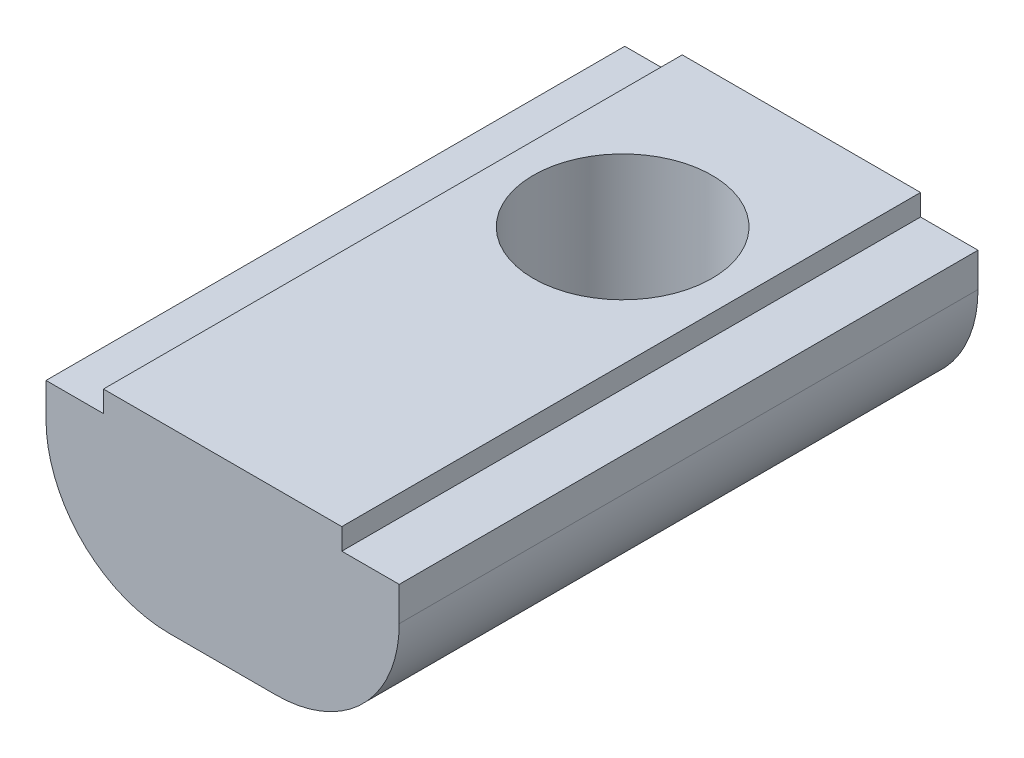
ISO-10303-21;
HEADER;
FILE_DESCRIPTION(('STEP AP214'),'2;1');
FILE_NAME('part.step','',(''),(''),'','','');
FILE_SCHEMA(('AUTOMOTIVE_DESIGN { 1 0 10303 214 1 1 1 1 }'));
ENDSEC;
DATA;
#1=APPLICATION_CONTEXT('core data for automotive mechanical design processes');
#2=APPLICATION_PROTOCOL_DEFINITION('international standard','automotive_design',2000,#1);
#3=PRODUCT_CONTEXT('',#1,'mechanical');
#4=PRODUCT('Part','Part','',(#3));
#5=PRODUCT_RELATED_PRODUCT_CATEGORY('part','',(#4));
#6=PRODUCT_DEFINITION_FORMATION('','',#4);
#7=PRODUCT_DEFINITION_CONTEXT('part definition',#1,'design');
#8=PRODUCT_DEFINITION('design','',#6,#7);
#9=PRODUCT_DEFINITION_SHAPE('','',#8);
#10=(LENGTH_UNIT() NAMED_UNIT(*) SI_UNIT(.MILLI.,.METRE.));
#11=(NAMED_UNIT(*) PLANE_ANGLE_UNIT() SI_UNIT($,.RADIAN.));
#12=(NAMED_UNIT(*) SI_UNIT($,.STERADIAN.) SOLID_ANGLE_UNIT());
#13=UNCERTAINTY_MEASURE_WITH_UNIT(LENGTH_MEASURE(1.E-05),#10,'distance_accuracy_value','');
#14=(GEOMETRIC_REPRESENTATION_CONTEXT(3) GLOBAL_UNCERTAINTY_ASSIGNED_CONTEXT((#13)) GLOBAL_UNIT_ASSIGNED_CONTEXT((#10,
#11,#12)) REPRESENTATION_CONTEXT('',''));
#15=CARTESIAN_POINT('',(0.,0.,0.));
#16=DIRECTION('',(0.,0.,1.));
#17=DIRECTION('',(1.,0.,0.));
#18=AXIS2_PLACEMENT_3D('',#15,#16,#17);
#19=CARTESIAN_POINT('',(1.25,-4.2,13.6));
#20=DIRECTION('',(0.,1.,0.));
#21=DIRECTION('',(0.,0.,1.));
#22=AXIS2_PLACEMENT_3D('',#19,#20,#21);
#23=PLANE('',#22);
#24=DIRECTION('',(0.,0.,-1.));
#25=VECTOR('',#24,1.);
#26=CARTESIAN_POINT('',(1.25,-4.2,13.6));
#27=LINE('',#26,#25);
#28=CARTESIAN_POINT('',(1.25,-4.2,2.51254629693139));
#29=VERTEX_POINT('',#28);
#30=CARTESIAN_POINT('',(1.25,-4.2,0.));
#31=VERTEX_POINT('',#30);
#32=EDGE_CURVE('E190',#29,#31,#27,.T.);
#33=ORIENTED_EDGE('',*,*,#32,.F.);
#34=CARTESIAN_POINT('',(0.,-4.2,4.2));
#35=DIRECTION('',(0.,1.,0.));
#36=DIRECTION('',(0.,0.,1.));
#37=AXIS2_PLACEMENT_3D('',#34,#35,#36);
#38=CIRCLE('',#37,2.1);
#39=CARTESIAN_POINT('',(-1.25,-4.2,2.51254629693138));
#40=VERTEX_POINT('',#39);
#41=EDGE_CURVE('E56',#29,#40,#38,.T.);
#42=ORIENTED_EDGE('',*,*,#41,.T.);
#43=DIRECTION('',(0.,0.,-1.));
#44=VECTOR('',#43,1.);
#45=CARTESIAN_POINT('',(-1.25,-4.2,13.6));
#46=LINE('',#45,#44);
#47=CARTESIAN_POINT('',(-1.25,-4.2,0.));
#48=VERTEX_POINT('',#47);
#49=EDGE_CURVE('E194',#40,#48,#46,.T.);
#50=ORIENTED_EDGE('',*,*,#49,.T.);
#51=DIRECTION('',(1.,0.,0.));
#52=VECTOR('',#51,1.);
#53=CARTESIAN_POINT('',(1.25,-4.2,0.));
#54=LINE('',#53,#52);
#55=EDGE_CURVE('E172',#48,#31,#54,.T.);
#56=ORIENTED_EDGE('',*,*,#55,.T.);
#57=EDGE_LOOP('',(#33,#42,#50,#56));
#58=FACE_BOUND('',#57,.T.);
#59=ADVANCED_FACE('F36',(#58),#23,.F.);
#60=CARTESIAN_POINT('',(-2.8,0.,13.6));
#61=DIRECTION('',(1.,0.,0.));
#62=DIRECTION('',(0.,0.,-1.));
#63=AXIS2_PLACEMENT_3D('',#60,#61,#62);
#64=PLANE('',#63);
#65=DIRECTION('',(0.,-1.,0.));
#66=VECTOR('',#65,1.);
#67=CARTESIAN_POINT('',(-2.8,0.,0.));
#68=LINE('',#67,#66);
#69=CARTESIAN_POINT('',(-2.8,0.,0.));
#70=VERTEX_POINT('',#69);
#71=CARTESIAN_POINT('',(-2.8,-0.500000000000001,0.));
#72=VERTEX_POINT('',#71);
#73=EDGE_CURVE('E161',#70,#72,#68,.T.);
#74=ORIENTED_EDGE('',*,*,#73,.T.);
#75=DIRECTION('',(0.,0.,-1.));
#76=VECTOR('',#75,1.);
#77=CARTESIAN_POINT('',(-2.8,-0.500000000000001,13.6));
#78=LINE('',#77,#76);
#79=CARTESIAN_POINT('',(-2.8,-0.500000000000001,13.6));
#80=VERTEX_POINT('',#79);
#81=EDGE_CURVE('E49',#80,#72,#78,.T.);
#82=ORIENTED_EDGE('',*,*,#81,.F.);
#83=DIRECTION('',(0.,-1.,0.));
#84=VECTOR('',#83,1.);
#85=CARTESIAN_POINT('',(-2.8,0.,13.6));
#86=LINE('',#85,#84);
#87=CARTESIAN_POINT('',(-2.8,0.,13.6));
#88=VERTEX_POINT('',#87);
#89=EDGE_CURVE('E183',#88,#80,#86,.T.);
#90=ORIENTED_EDGE('',*,*,#89,.F.);
#91=DIRECTION('',(0.,0.,-1.));
#92=VECTOR('',#91,1.);
#93=CARTESIAN_POINT('',(-2.8,0.,13.6));
#94=LINE('',#93,#92);
#95=EDGE_CURVE('E157',#88,#70,#94,.T.);
#96=ORIENTED_EDGE('',*,*,#95,.T.);
#97=EDGE_LOOP('',(#74,#82,#90,#96));
#98=FACE_BOUND('',#97,.T.);
#99=ADVANCED_FACE('F38',(#98),#64,.F.);
#100=CARTESIAN_POINT('',(-2.8,-0.500000000000001,13.6));
#101=DIRECTION('',(0.,-1.,0.));
#102=DIRECTION('',(1.,0.,0.));
#103=AXIS2_PLACEMENT_3D('',#100,#101,#102);
#104=PLANE('',#103);
#105=DIRECTION('',(-1.,0.,0.));
#106=VECTOR('',#105,1.);
#107=CARTESIAN_POINT('',(-2.8,-0.500000000000001,0.));
#108=LINE('',#107,#106);
#109=CARTESIAN_POINT('',(-4.15,-0.500000000000002,0.));
#110=VERTEX_POINT('',#109);
#111=EDGE_CURVE('E164',#72,#110,#108,.T.);
#112=ORIENTED_EDGE('',*,*,#111,.T.);
#113=DIRECTION('',(0.,0.,-1.));
#114=VECTOR('',#113,1.);
#115=CARTESIAN_POINT('',(-4.15,-0.500000000000002,13.6));
#116=LINE('',#115,#114);
#117=CARTESIAN_POINT('',(-4.15,-0.500000000000002,13.6));
#118=VERTEX_POINT('',#117);
#119=EDGE_CURVE('E201',#118,#110,#116,.T.);
#120=ORIENTED_EDGE('',*,*,#119,.F.);
#121=DIRECTION('',(-1.,0.,0.));
#122=VECTOR('',#121,1.);
#123=CARTESIAN_POINT('',(-2.8,-0.500000000000001,13.6));
#124=LINE('',#123,#122);
#125=EDGE_CURVE('E112',#80,#118,#124,.T.);
#126=ORIENTED_EDGE('',*,*,#125,.F.);
#127=ORIENTED_EDGE('',*,*,#81,.T.);
#128=EDGE_LOOP('',(#112,#120,#126,#127));
#129=FACE_BOUND('',#128,.T.);
#130=ADVANCED_FACE('F204',(#129),#104,.F.);
#131=CARTESIAN_POINT('',(-4.15,-0.500000000000002,13.6));
#132=DIRECTION('',(1.,0.,0.));
#133=DIRECTION('',(0.,1.,0.));
#134=AXIS2_PLACEMENT_3D('',#131,#132,#133);
#135=PLANE('',#134);
#136=DIRECTION('',(0.,-1.,0.));
#137=VECTOR('',#136,1.);
#138=CARTESIAN_POINT('',(-4.15,-0.500000000000002,0.));
#139=LINE('',#138,#137);
#140=CARTESIAN_POINT('',(-4.15,-1.3,0.));
#141=VERTEX_POINT('',#140);
#142=EDGE_CURVE('E167',#110,#141,#139,.T.);
#143=ORIENTED_EDGE('',*,*,#142,.T.);
#144=DIRECTION('',(0.,0.,-1.));
#145=VECTOR('',#144,1.);
#146=CARTESIAN_POINT('',(-4.15,-1.3,13.6));
#147=LINE('',#146,#145);
#148=CARTESIAN_POINT('',(-4.15,-1.3,13.6));
#149=VERTEX_POINT('',#148);
#150=EDGE_CURVE('E198',#149,#141,#147,.T.);
#151=ORIENTED_EDGE('',*,*,#150,.F.);
#152=DIRECTION('',(0.,-1.,0.));
#153=VECTOR('',#152,1.);
#154=CARTESIAN_POINT('',(-4.15,-0.500000000000002,13.6));
#155=LINE('',#154,#153);
#156=EDGE_CURVE('E226',#118,#149,#155,.T.);
#157=ORIENTED_EDGE('',*,*,#156,.F.);
#158=ORIENTED_EDGE('',*,*,#119,.T.);
#159=EDGE_LOOP('',(#143,#151,#157,#158));
#160=FACE_BOUND('',#159,.T.);
#161=ADVANCED_FACE('F215',(#160),#135,.F.);
#162=CARTESIAN_POINT('',(-1.25,-1.3,13.6));
#163=DIRECTION('',(0.,0.,-1.));
#164=DIRECTION('',(-1.,0.,0.));
#165=AXIS2_PLACEMENT_3D('',#162,#163,#164);
#166=CYLINDRICAL_SURFACE('',#165,2.9);
#167=ORIENTED_EDGE('',*,*,#49,.F.);
#168=CARTESIAN_POINT('',(-1.25,-4.2,2.51254629693139));
#169=CARTESIAN_POINT('',(-1.29679302358815,-4.20000162779569,2.54720613147119));
#170=CARTESIAN_POINT('',(-1.34210654962089,-4.19886739033813,2.58379078243395));
#171=CARTESIAN_POINT('',(-1.4294736763495,-4.19477086092717,2.66052497288662));
#172=CARTESIAN_POINT('',(-1.47152921453861,-4.19180966498832,2.70067236269233));
#173=CARTESIAN_POINT('',(-1.592248134523,-4.18086528521206,2.82589932642326));
#174=CARTESIAN_POINT('',(-1.66568861699531,-4.17081709738618,2.91593083823853));
#175=CARTESIAN_POINT('',(-1.79653736935906,-4.14880886083169,3.10646718108679));
#176=CARTESIAN_POINT('',(-1.85396894665814,-4.13685163182472,3.20695649052462));
#177=CARTESIAN_POINT('',(-1.95164145345667,-4.11428820760309,3.41615592729943));
#178=CARTESIAN_POINT('',(-1.99188016659913,-4.10368218669823,3.5248671124055));
#179=CARTESIAN_POINT('',(-2.05475080974325,-4.08630297770265,3.75050603803357));
#180=CARTESIAN_POINT('',(-2.07692477596599,-4.07963060370359,3.8675701892581));
#181=CARTESIAN_POINT('',(-2.10115925572021,-4.07230905515833,4.10392796490177));
#182=CARTESIAN_POINT('',(-2.10322722383182,-4.07165764825874,4.22322074658743));
#183=CARTESIAN_POINT('',(-2.08752919593551,-4.0764360699222,4.45531928550419));
#184=CARTESIAN_POINT('',(-2.07058949668459,-4.08161258036382,4.56818761625929));
#185=CARTESIAN_POINT('',(-2.01877355247524,-4.0963731756978,4.78947091338401));
#186=CARTESIAN_POINT('',(-1.98388735921023,-4.10595970489033,4.89788337369169));
#187=CARTESIAN_POINT('',(-1.89658041100682,-4.1273615966629,5.10896845544056));
#188=CARTESIAN_POINT('',(-1.8439163503699,-4.13920683519873,5.21153699074508));
#189=CARTESIAN_POINT('',(-1.72251496587779,-4.161909220898,5.40669827924429));
#190=CARTESIAN_POINT('',(-1.65379590412449,-4.17276747138328,5.49930219339976));
#191=CARTESIAN_POINT('',(-1.52885656363337,-4.18698274872469,5.64156955318508));
#192=CARTESIAN_POINT('',(-1.47682649154659,-4.19163447976084,5.69482718365556));
#193=CARTESIAN_POINT('',(-1.36734216390807,-4.19814513030808,5.79559425268969));
#194=CARTESIAN_POINT('',(-1.30988916461216,-4.20000469496297,5.84310501676177));
#195=CARTESIAN_POINT('',(-1.25,-4.2,5.88745370306861));
#196=B_SPLINE_CURVE_WITH_KNOTS('',3,(#168,#169,#170,#171,#172,#173,#174,#175,#176,#177,#178,
#179,#180,#181,#182,#183,#184,#185,#186,#187,#188,#189,#190,#191,#192,#193,#194,#195),
.UNSPECIFIED.,.F.,.F.,(4,2,2,2,2,2,2,2,2,2,2,2,2,4),(0.,0.174556159947332,0.349007703224587,
0.69708176058304,1.0446463771914,1.39225578534907,1.74842501068925,2.10446217626738,
2.44560159052293,2.78693031319363,3.1331337485854,3.47894528846722,3.70230915212592,
3.92562139851794),.UNSPECIFIED.);
#197=CARTESIAN_POINT('',(-1.25,-4.2,5.88745370306862));
#198=VERTEX_POINT('',#197);
#199=EDGE_CURVE('E165',#40,#198,#196,.T.);
#200=ORIENTED_EDGE('',*,*,#199,.T.);
#201=CARTESIAN_POINT('',(-1.25,-4.2,13.6));
#202=VERTEX_POINT('',#201);
#203=EDGE_CURVE('E195',#202,#198,#46,.T.);
#204=ORIENTED_EDGE('',*,*,#203,.F.);
#205=CARTESIAN_POINT('',(-1.25,-1.3,13.6));
#206=DIRECTION('',(0.,0.,1.));
#207=DIRECTION('',(-1.,0.,0.));
#208=AXIS2_PLACEMENT_3D('',#205,#206,#207);
#209=CIRCLE('',#208,2.9);
#210=EDGE_CURVE('E222',#149,#202,#209,.T.);
#211=ORIENTED_EDGE('',*,*,#210,.F.);
#212=ORIENTED_EDGE('',*,*,#150,.T.);
#213=CARTESIAN_POINT('',(-1.25,-1.3,0.));
#214=DIRECTION('',(0.,0.,1.));
#215=DIRECTION('',(-1.,0.,0.));
#216=AXIS2_PLACEMENT_3D('',#213,#214,#215);
#217=CIRCLE('',#216,2.9);
#218=EDGE_CURVE('E169',#141,#48,#217,.T.);
#219=ORIENTED_EDGE('',*,*,#218,.T.);
#220=EDGE_LOOP('',(#167,#200,#204,#211,#212,#219));
#221=FACE_BOUND('',#220,.T.);
#222=ADVANCED_FACE('F220',(#221),#166,.T.);
#223=ORIENTED_EDGE('',*,*,#203,.T.);
#224=CARTESIAN_POINT('',(1.25,-4.2,5.88745370306862));
#225=VERTEX_POINT('',#224);
#226=EDGE_CURVE('E250',#198,#225,#38,.T.);
#227=ORIENTED_EDGE('',*,*,#226,.T.);
#228=CARTESIAN_POINT('',(1.25,-4.2,13.6));
#229=VERTEX_POINT('',#228);
#230=EDGE_CURVE('E191',#229,#225,#27,.T.);
#231=ORIENTED_EDGE('',*,*,#230,.F.);
#232=DIRECTION('',(1.,0.,0.));
#233=VECTOR('',#232,1.);
#234=CARTESIAN_POINT('',(1.25,-4.2,13.6));
#235=LINE('',#234,#233);
#236=EDGE_CURVE('E225',#202,#229,#235,.T.);
#237=ORIENTED_EDGE('',*,*,#236,.F.);
#238=EDGE_LOOP('',(#223,#227,#231,#237));
#239=FACE_BOUND('',#238,.T.);
#240=ADVANCED_FACE('F275',(#239),#23,.F.);
#241=CARTESIAN_POINT('',(1.25,-1.3,13.6));
#242=DIRECTION('',(0.,0.,-1.));
#243=DIRECTION('',(-1.,0.,0.));
#244=AXIS2_PLACEMENT_3D('',#241,#242,#243);
#245=CYLINDRICAL_SURFACE('',#244,2.9);
#246=ORIENTED_EDGE('',*,*,#230,.T.);
#247=CARTESIAN_POINT('',(1.25,-4.2,5.88745370306861));
#248=CARTESIAN_POINT('',(1.29679302358816,-4.20000162779569,5.85279386852881));
#249=CARTESIAN_POINT('',(1.34210654962089,-4.19886739033813,5.81620921756605));
#250=CARTESIAN_POINT('',(1.4294736763495,-4.19477086092717,5.73947502711338));
#251=CARTESIAN_POINT('',(1.47152921453861,-4.19180966498832,5.69932763730767));
#252=CARTESIAN_POINT('',(1.592248134523,-4.18086528521206,5.57410067357674));
#253=CARTESIAN_POINT('',(1.66568861699531,-4.17081709738618,5.48406916176148));
#254=CARTESIAN_POINT('',(1.79653736935906,-4.14880886083169,5.29353281891321));
#255=CARTESIAN_POINT('',(1.85396894665814,-4.13685163182472,5.19304350947538));
#256=CARTESIAN_POINT('',(1.95164145345667,-4.11428820760309,4.98384407270057));
#257=CARTESIAN_POINT('',(1.99188016659913,-4.10368218669823,4.8751328875945));
#258=CARTESIAN_POINT('',(2.05475080974325,-4.08630297770265,4.64949396196644));
#259=CARTESIAN_POINT('',(2.07692477596599,-4.07963060370359,4.5324298107419));
#260=CARTESIAN_POINT('',(2.10115925572021,-4.07230905515833,4.29607203509823));
#261=CARTESIAN_POINT('',(2.10322722383183,-4.07165764825874,4.17677925341258));
#262=CARTESIAN_POINT('',(2.08752919593551,-4.0764360699222,3.94468071449581));
#263=CARTESIAN_POINT('',(2.0705894966846,-4.08161258036382,3.83181238374071));
#264=CARTESIAN_POINT('',(2.01877355247524,-4.0963731756978,3.610529086616));
#265=CARTESIAN_POINT('',(1.98388735921023,-4.10595970489033,3.50211662630831));
#266=CARTESIAN_POINT('',(1.89658041100682,-4.1273615966629,3.29103154455944));
#267=CARTESIAN_POINT('',(1.8439163503699,-4.13920683519873,3.18846300925493));
#268=CARTESIAN_POINT('',(1.72251496587779,-4.161909220898,2.99330172075571));
#269=CARTESIAN_POINT('',(1.65379590412449,-4.17276747138328,2.90069780660024));
#270=CARTESIAN_POINT('',(1.52885656363337,-4.18698274872469,2.75843044681492));
#271=CARTESIAN_POINT('',(1.47682649154659,-4.19163447976084,2.70517281634444));
#272=CARTESIAN_POINT('',(1.36734216390807,-4.19814513030808,2.60440574731031));
#273=CARTESIAN_POINT('',(1.30988916461216,-4.20000469496297,2.55689498323824));
#274=CARTESIAN_POINT('',(1.25,-4.2,2.51254629693139));
#275=B_SPLINE_CURVE_WITH_KNOTS('',3,(#247,#248,#249,#250,#251,#252,#253,#254,#255,#256,#257,
#258,#259,#260,#261,#262,#263,#264,#265,#266,#267,#268,#269,#270,#271,#272,#273,#274),
.UNSPECIFIED.,.F.,.F.,(4,2,2,2,2,2,2,2,2,2,2,2,2,4),(0.,0.174556159947332,0.349007703224586,
0.697081760583039,1.0446463771914,1.39225578534907,1.74842501068925,2.10446217626738,
2.44560159052293,2.78693031319363,3.1331337485854,3.47894528846721,3.70230915212592,
3.92562139851794),.UNSPECIFIED.);
#276=EDGE_CURVE('E11',#225,#29,#275,.T.);
#277=ORIENTED_EDGE('',*,*,#276,.T.);
#278=ORIENTED_EDGE('',*,*,#32,.T.);
#279=CARTESIAN_POINT('',(1.25,-1.3,0.));
#280=DIRECTION('',(0.,0.,1.));
#281=DIRECTION('',(1.,0.,0.));
#282=AXIS2_PLACEMENT_3D('',#279,#280,#281);
#283=CIRCLE('',#282,2.9);
#284=CARTESIAN_POINT('',(4.15,-1.3,0.));
#285=VERTEX_POINT('',#284);
#286=EDGE_CURVE('E175',#31,#285,#283,.T.);
#287=ORIENTED_EDGE('',*,*,#286,.T.);
#288=DIRECTION('',(0.,0.,-1.));
#289=VECTOR('',#288,1.);
#290=CARTESIAN_POINT('',(4.15,-1.3,13.6));
#291=LINE('',#290,#289);
#292=CARTESIAN_POINT('',(4.15,-1.3,13.6));
#293=VERTEX_POINT('',#292);
#294=EDGE_CURVE('E187',#293,#285,#291,.T.);
#295=ORIENTED_EDGE('',*,*,#294,.F.);
#296=CARTESIAN_POINT('',(1.25,-1.3,13.6));
#297=DIRECTION('',(0.,0.,1.));
#298=DIRECTION('',(1.,0.,0.));
#299=AXIS2_PLACEMENT_3D('',#296,#297,#298);
#300=CIRCLE('',#299,2.9);
#301=EDGE_CURVE('E228',#229,#293,#300,.T.);
#302=ORIENTED_EDGE('',*,*,#301,.F.);
#303=EDGE_LOOP('',(#246,#277,#278,#287,#295,#302));
#304=FACE_BOUND('',#303,.T.);
#305=ADVANCED_FACE('F237',(#304),#245,.T.);
#306=CARTESIAN_POINT('',(4.15,-0.500000000000002,13.6));
#307=DIRECTION('',(-1.,0.,0.));
#308=DIRECTION('',(0.,-1.,0.));
#309=AXIS2_PLACEMENT_3D('',#306,#307,#308);
#310=PLANE('',#309);
#311=DIRECTION('',(0.,1.,0.));
#312=VECTOR('',#311,1.);
#313=CARTESIAN_POINT('',(4.15,-0.500000000000002,0.));
#314=LINE('',#313,#312);
#315=CARTESIAN_POINT('',(4.15,-0.500000000000002,0.));
#316=VERTEX_POINT('',#315);
#317=EDGE_CURVE('E177',#285,#316,#314,.T.);
#318=ORIENTED_EDGE('',*,*,#317,.T.);
#319=DIRECTION('',(0.,0.,-1.));
#320=VECTOR('',#319,1.);
#321=CARTESIAN_POINT('',(4.15,-0.500000000000002,13.6));
#322=LINE('',#321,#320);
#323=CARTESIAN_POINT('',(4.15,-0.500000000000002,13.6));
#324=VERTEX_POINT('',#323);
#325=EDGE_CURVE('E152',#324,#316,#322,.T.);
#326=ORIENTED_EDGE('',*,*,#325,.F.);
#327=DIRECTION('',(0.,1.,0.));
#328=VECTOR('',#327,1.);
#329=CARTESIAN_POINT('',(4.15,-0.500000000000002,13.6));
#330=LINE('',#329,#328);
#331=EDGE_CURVE('E140',#293,#324,#330,.T.);
#332=ORIENTED_EDGE('',*,*,#331,.F.);
#333=ORIENTED_EDGE('',*,*,#294,.T.);
#334=EDGE_LOOP('',(#318,#326,#332,#333));
#335=FACE_BOUND('',#334,.T.);
#336=ADVANCED_FACE('F241',(#335),#310,.F.);
#337=CARTESIAN_POINT('',(2.8,-0.500000000000001,13.6));
#338=DIRECTION('',(0.,-1.,0.));
#339=DIRECTION('',(1.,0.,0.));
#340=AXIS2_PLACEMENT_3D('',#337,#338,#339);
#341=PLANE('',#340);
#342=DIRECTION('',(-1.,0.,0.));
#343=VECTOR('',#342,1.);
#344=CARTESIAN_POINT('',(2.8,-0.500000000000001,0.));
#345=LINE('',#344,#343);
#346=CARTESIAN_POINT('',(2.8,-0.500000000000001,0.));
#347=VERTEX_POINT('',#346);
#348=EDGE_CURVE('E149',#316,#347,#345,.T.);
#349=ORIENTED_EDGE('',*,*,#348,.T.);
#350=DIRECTION('',(0.,0.,-1.));
#351=VECTOR('',#350,1.);
#352=CARTESIAN_POINT('',(2.8,-0.500000000000001,13.6));
#353=LINE('',#352,#351);
#354=CARTESIAN_POINT('',(2.8,-0.500000000000001,13.6));
#355=VERTEX_POINT('',#354);
#356=EDGE_CURVE('E146',#355,#347,#353,.T.);
#357=ORIENTED_EDGE('',*,*,#356,.F.);
#358=DIRECTION('',(-1.,0.,0.));
#359=VECTOR('',#358,1.);
#360=CARTESIAN_POINT('',(2.8,-0.500000000000001,13.6));
#361=LINE('',#360,#359);
#362=EDGE_CURVE('E133',#324,#355,#361,.T.);
#363=ORIENTED_EDGE('',*,*,#362,.F.);
#364=ORIENTED_EDGE('',*,*,#325,.T.);
#365=EDGE_LOOP('',(#349,#357,#363,#364));
#366=FACE_BOUND('',#365,.T.);
#367=ADVANCED_FACE('F147',(#366),#341,.F.);
#368=CARTESIAN_POINT('',(2.8,0.,13.6));
#369=DIRECTION('',(-1.,0.,0.));
#370=DIRECTION('',(0.,0.,1.));
#371=AXIS2_PLACEMENT_3D('',#368,#369,#370);
#372=PLANE('',#371);
#373=DIRECTION('',(0.,1.,0.));
#374=VECTOR('',#373,1.);
#375=CARTESIAN_POINT('',(2.8,0.,0.));
#376=LINE('',#375,#374);
#377=CARTESIAN_POINT('',(2.8,0.,0.));
#378=VERTEX_POINT('',#377);
#379=EDGE_CURVE('E180',#347,#378,#376,.T.);
#380=ORIENTED_EDGE('',*,*,#379,.T.);
#381=DIRECTION('',(0.,0.,-1.));
#382=VECTOR('',#381,1.);
#383=CARTESIAN_POINT('',(2.8,0.,13.6));
#384=LINE('',#383,#382);
#385=CARTESIAN_POINT('',(2.8,0.,13.6));
#386=VERTEX_POINT('',#385);
#387=EDGE_CURVE('E153',#386,#378,#384,.T.);
#388=ORIENTED_EDGE('',*,*,#387,.F.);
#389=DIRECTION('',(0.,1.,0.));
#390=VECTOR('',#389,1.);
#391=CARTESIAN_POINT('',(2.8,0.,13.6));
#392=LINE('',#391,#390);
#393=EDGE_CURVE('E137',#355,#386,#392,.T.);
#394=ORIENTED_EDGE('',*,*,#393,.F.);
#395=ORIENTED_EDGE('',*,*,#356,.T.);
#396=EDGE_LOOP('',(#380,#388,#394,#395));
#397=FACE_BOUND('',#396,.T.);
#398=ADVANCED_FACE('F155',(#397),#372,.F.);
#399=CARTESIAN_POINT('',(2.8,0.,13.6));
#400=DIRECTION('',(0.,-1.,0.));
#401=DIRECTION('',(0.,0.,-1.));
#402=AXIS2_PLACEMENT_3D('',#399,#400,#401);
#403=PLANE('',#402);
#404=CARTESIAN_POINT('',(0.,0.,4.2));
#405=DIRECTION('',(0.,1.,0.));
#406=DIRECTION('',(0.,0.,1.));
#407=AXIS2_PLACEMENT_3D('',#404,#405,#406);
#408=CIRCLE('',#407,2.09999999999999);
#409=CARTESIAN_POINT('',(0.,0.,6.29999999999999));
#410=VERTEX_POINT('',#409);
#411=EDGE_CURVE('E292',#410,#410,#408,.T.);
#412=ORIENTED_EDGE('',*,*,#411,.F.);
#413=EDGE_LOOP('',(#412));
#414=FACE_BOUND('',#413,.T.);
#415=DIRECTION('',(-1.,0.,0.));
#416=VECTOR('',#415,1.);
#417=CARTESIAN_POINT('',(2.8,0.,0.));
#418=LINE('',#417,#416);
#419=EDGE_CURVE('E103',#378,#70,#418,.T.);
#420=ORIENTED_EDGE('',*,*,#419,.T.);
#421=ORIENTED_EDGE('',*,*,#95,.F.);
#422=DIRECTION('',(-1.,0.,0.));
#423=VECTOR('',#422,1.);
#424=CARTESIAN_POINT('',(2.8,0.,13.6));
#425=LINE('',#424,#423);
#426=EDGE_CURVE('E64',#386,#88,#425,.T.);
#427=ORIENTED_EDGE('',*,*,#426,.F.);
#428=ORIENTED_EDGE('',*,*,#387,.T.);
#429=EDGE_LOOP('',(#420,#421,#427,#428));
#430=FACE_BOUND('',#429,.T.);
#431=ADVANCED_FACE('F242',(#414,#430),#403,.F.);
#432=CARTESIAN_POINT('',(-1.25,-1.3,13.6));
#433=DIRECTION('',(0.,0.,-1.));
#434=DIRECTION('',(-1.,0.,0.));
#435=AXIS2_PLACEMENT_3D('',#432,#433,#434);
#436=PLANE('',#435);
#437=ORIENTED_EDGE('',*,*,#89,.T.);
#438=ORIENTED_EDGE('',*,*,#125,.T.);
#439=ORIENTED_EDGE('',*,*,#156,.T.);
#440=ORIENTED_EDGE('',*,*,#210,.T.);
#441=ORIENTED_EDGE('',*,*,#236,.T.);
#442=ORIENTED_EDGE('',*,*,#301,.T.);
#443=ORIENTED_EDGE('',*,*,#331,.T.);
#444=ORIENTED_EDGE('',*,*,#362,.T.);
#445=ORIENTED_EDGE('',*,*,#393,.T.);
#446=ORIENTED_EDGE('',*,*,#426,.T.);
#447=EDGE_LOOP('',(#437,#438,#439,#440,#441,#442,#443,#444,#445,#446));
#448=FACE_BOUND('',#447,.T.);
#449=ADVANCED_FACE('F135',(#448),#436,.F.);
#450=CARTESIAN_POINT('',(-1.25,-1.3,0.));
#451=DIRECTION('',(0.,0.,-1.));
#452=DIRECTION('',(-1.,0.,0.));
#453=AXIS2_PLACEMENT_3D('',#450,#451,#452);
#454=PLANE('',#453);
#455=ORIENTED_EDGE('',*,*,#73,.F.);
#456=ORIENTED_EDGE('',*,*,#419,.F.);
#457=ORIENTED_EDGE('',*,*,#379,.F.);
#458=ORIENTED_EDGE('',*,*,#348,.F.);
#459=ORIENTED_EDGE('',*,*,#317,.F.);
#460=ORIENTED_EDGE('',*,*,#286,.F.);
#461=ORIENTED_EDGE('',*,*,#55,.F.);
#462=ORIENTED_EDGE('',*,*,#218,.F.);
#463=ORIENTED_EDGE('',*,*,#142,.F.);
#464=ORIENTED_EDGE('',*,*,#111,.F.);
#465=EDGE_LOOP('',(#455,#456,#457,#458,#459,#460,#461,#462,#463,#464));
#466=FACE_BOUND('',#465,.T.);
#467=ADVANCED_FACE('F209',(#466),#454,.T.);
#468=CARTESIAN_POINT('',(0.,0.,4.2));
#469=DIRECTION('',(0.,1.,0.));
#470=DIRECTION('',(0.,0.,1.));
#471=AXIS2_PLACEMENT_3D('',#468,#469,#470);
#472=CYLINDRICAL_SURFACE('',#471,2.09999999999999);
#473=ORIENTED_EDGE('',*,*,#411,.T.);
#474=EDGE_LOOP('',(#473));
#475=FACE_BOUND('',#474,.T.);
#476=ORIENTED_EDGE('',*,*,#41,.F.);
#477=ORIENTED_EDGE('',*,*,#276,.F.);
#478=ORIENTED_EDGE('',*,*,#226,.F.);
#479=ORIENTED_EDGE('',*,*,#199,.F.);
#480=EDGE_LOOP('',(#476,#477,#478,#479));
#481=FACE_BOUND('',#480,.T.);
#482=ADVANCED_FACE('F255',(#475,#481),#472,.F.);
#483=CLOSED_SHELL('',(#59,#99,#130,#161,#222,#240,#305,#336,#367,#398,#431,#449,#467,#482));
#484=MANIFOLD_SOLID_BREP('B2',#483);
#485=ADVANCED_BREP_SHAPE_REPRESENTATION('',(#18,#484),#14);
#486=SHAPE_DEFINITION_REPRESENTATION(#9,#485);
ENDSEC;
END-ISO-10303-21;
